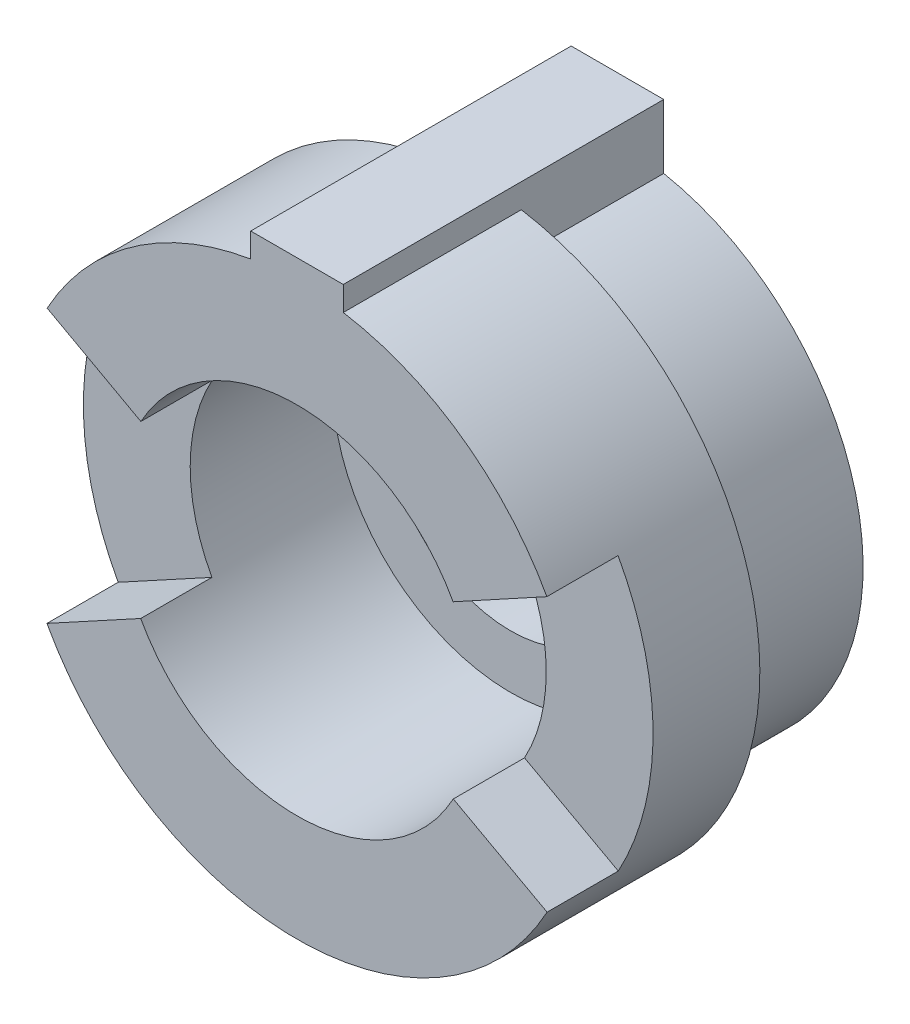
ISO-10303-21;
HEADER;
FILE_DESCRIPTION(('STEP AP214'),'2;1');
FILE_NAME('part.step','',(''),(''),'','','');
FILE_SCHEMA(('AUTOMOTIVE_DESIGN { 1 0 10303 214 1 1 1 1 }'));
ENDSEC;
DATA;
#1=APPLICATION_CONTEXT('core data for automotive mechanical design processes');
#2=APPLICATION_PROTOCOL_DEFINITION('international standard','automotive_design',2000,#1);
#3=PRODUCT_CONTEXT('',#1,'mechanical');
#4=PRODUCT('Part','Part','',(#3));
#5=PRODUCT_RELATED_PRODUCT_CATEGORY('part','',(#4));
#6=PRODUCT_DEFINITION_FORMATION('','',#4);
#7=PRODUCT_DEFINITION_CONTEXT('part definition',#1,'design');
#8=PRODUCT_DEFINITION('design','',#6,#7);
#9=PRODUCT_DEFINITION_SHAPE('','',#8);
#10=(LENGTH_UNIT() NAMED_UNIT(*) SI_UNIT(.MILLI.,.METRE.));
#11=(NAMED_UNIT(*) PLANE_ANGLE_UNIT() SI_UNIT($,.RADIAN.));
#12=(NAMED_UNIT(*) SI_UNIT($,.STERADIAN.) SOLID_ANGLE_UNIT());
#13=UNCERTAINTY_MEASURE_WITH_UNIT(LENGTH_MEASURE(1.E-05),#10,'distance_accuracy_value','');
#14=(GEOMETRIC_REPRESENTATION_CONTEXT(3) GLOBAL_UNCERTAINTY_ASSIGNED_CONTEXT((#13)) GLOBAL_UNIT_ASSIGNED_CONTEXT((#10,
#11,#12)) REPRESENTATION_CONTEXT('',''));
#15=CARTESIAN_POINT('',(0.,0.,0.));
#16=DIRECTION('',(0.,0.,1.));
#17=DIRECTION('',(1.,0.,0.));
#18=AXIS2_PLACEMENT_3D('',#15,#16,#17);
#19=CARTESIAN_POINT('',(0.,0.,9.));
#20=DIRECTION('',(0.,0.,1.));
#21=DIRECTION('',(1.,0.,0.));
#22=AXIS2_PLACEMENT_3D('',#19,#20,#21);
#23=PLANE('',#22);
#24=DIRECTION('',(0.,1.,0.));
#25=VECTOR('',#24,1.);
#26=CARTESIAN_POINT('',(-1.29999999999996,8.57642973843896,9.));
#27=LINE('',#26,#25);
#28=CARTESIAN_POINT('',(-1.29999999999996,7.89366834874636,9.));
#29=VERTEX_POINT('',#28);
#30=CARTESIAN_POINT('',(-1.29999999999996,8.57642973843896,9.));
#31=VERTEX_POINT('',#30);
#32=EDGE_CURVE('E181',#29,#31,#27,.T.);
#33=ORIENTED_EDGE('',*,*,#32,.F.);
#34=CARTESIAN_POINT('',(0.,0.,9.));
#35=DIRECTION('',(0.,0.,1.));
#36=DIRECTION('',(1.,0.,0.));
#37=AXIS2_PLACEMENT_3D('',#34,#35,#36);
#38=CIRCLE('',#37,8.);
#39=CARTESIAN_POINT('',(-7.01760403419745,3.84099383222828,9.));
#40=VERTEX_POINT('',#39);
#41=EDGE_CURVE('E84',#29,#40,#38,.T.);
#42=ORIENTED_EDGE('',*,*,#41,.T.);
#43=DIRECTION('',(-0.877200504274681,0.480124229028535,0.));
#44=VECTOR('',#43,1.);
#45=CARTESIAN_POINT('',(-7.01760403419745,3.84099383222828,9.));
#46=LINE('',#45,#44);
#47=CARTESIAN_POINT('',(-4.38600252137341,2.40062114514268,9.));
#48=VERTEX_POINT('',#47);
#49=EDGE_CURVE('E234',#48,#40,#46,.T.);
#50=ORIENTED_EDGE('',*,*,#49,.F.);
#51=CARTESIAN_POINT('',(0.,0.,9.));
#52=DIRECTION('',(0.,0.,1.));
#53=DIRECTION('',(1.,0.,0.));
#54=AXIS2_PLACEMENT_3D('',#51,#52,#53);
#55=CIRCLE('',#54,5.);
#56=CARTESIAN_POINT('',(4.38600252137341,2.40062114514267,9.));
#57=VERTEX_POINT('',#56);
#58=EDGE_CURVE('E259',#57,#48,#55,.T.);
#59=ORIENTED_EDGE('',*,*,#58,.F.);
#60=DIRECTION('',(0.877200504274682,0.480124229028534,0.));
#61=VECTOR('',#60,1.);
#62=CARTESIAN_POINT('',(7.01760403419745,3.84099383222827,9.));
#63=LINE('',#62,#61);
#64=CARTESIAN_POINT('',(7.01760403419745,3.84099383222827,9.));
#65=VERTEX_POINT('',#64);
#66=EDGE_CURVE('E255',#57,#65,#63,.T.);
#67=ORIENTED_EDGE('',*,*,#66,.T.);
#68=CARTESIAN_POINT('',(1.30000000000003,7.89366834874635,9.));
#69=VERTEX_POINT('',#68);
#70=EDGE_CURVE('E188',#65,#69,#38,.T.);
#71=ORIENTED_EDGE('',*,*,#70,.T.);
#72=DIRECTION('',(0.,-1.,0.));
#73=VECTOR('',#72,1.);
#74=CARTESIAN_POINT('',(1.30000000000003,7.79714939560114,9.));
#75=LINE('',#74,#73);
#76=CARTESIAN_POINT('',(1.30000000000003,8.57642973843896,9.));
#77=VERTEX_POINT('',#76);
#78=EDGE_CURVE('E173',#77,#69,#75,.T.);
#79=ORIENTED_EDGE('',*,*,#78,.F.);
#80=DIRECTION('',(1.,0.,0.));
#81=VECTOR('',#80,1.);
#82=CARTESIAN_POINT('',(1.30000000000003,8.57642973843896,9.));
#83=LINE('',#82,#81);
#84=EDGE_CURVE('E186',#31,#77,#83,.T.);
#85=ORIENTED_EDGE('',*,*,#84,.F.);
#86=EDGE_LOOP('',(#33,#42,#50,#59,#67,#71,#79,#85));
#87=FACE_BOUND('',#86,.T.);
#88=ADVANCED_FACE('F69',(#87),#23,.T.);
#89=CARTESIAN_POINT('',(0.,0.,3.));
#90=DIRECTION('',(0.,0.,1.));
#91=DIRECTION('',(1.,0.,0.));
#92=AXIS2_PLACEMENT_3D('',#89,#90,#91);
#93=PLANE('',#92);
#94=CARTESIAN_POINT('',(0.,0.,3.));
#95=DIRECTION('',(0.,0.,1.));
#96=DIRECTION('',(1.,0.,0.));
#97=AXIS2_PLACEMENT_3D('',#94,#95,#96);
#98=CIRCLE('',#97,5.);
#99=CARTESIAN_POINT('',(5.,0.,3.));
#100=VERTEX_POINT('',#99);
#101=EDGE_CURVE('E268',#100,#100,#98,.F.);
#102=ORIENTED_EDGE('',*,*,#101,.F.);
#103=EDGE_LOOP('',(#102));
#104=FACE_BOUND('',#103,.T.);
#105=CARTESIAN_POINT('',(0.,0.,3.));
#106=DIRECTION('',(0.,0.,1.));
#107=DIRECTION('',(1.,0.,0.));
#108=AXIS2_PLACEMENT_3D('',#105,#106,#107);
#109=CIRCLE('',#108,3.5);
#110=CARTESIAN_POINT('',(3.5,0.,3.));
#111=VERTEX_POINT('',#110);
#112=EDGE_CURVE('E265',#111,#111,#109,.T.);
#113=ORIENTED_EDGE('',*,*,#112,.F.);
#114=EDGE_LOOP('',(#113));
#115=FACE_BOUND('',#114,.T.);
#116=ADVANCED_FACE('F329',(#104,#115),#93,.T.);
#117=CARTESIAN_POINT('',(0.,0.,0.));
#118=DIRECTION('',(0.,0.,1.));
#119=DIRECTION('',(1.,0.,0.));
#120=AXIS2_PLACEMENT_3D('',#117,#118,#119);
#121=PLANE('',#120);
#122=CARTESIAN_POINT('',(0.,0.,0.));
#123=DIRECTION('',(0.,0.,1.));
#124=DIRECTION('',(-1.,0.,0.));
#125=AXIS2_PLACEMENT_3D('',#122,#123,#124);
#126=CIRCLE('',#125,6.9);
#127=CARTESIAN_POINT('',(-1.3,6.77642973843897,0.));
#128=VERTEX_POINT('',#127);
#129=CARTESIAN_POINT('',(1.30000000000003,6.77642973843896,0.));
#130=VERTEX_POINT('',#129);
#131=EDGE_CURVE('E215',#128,#130,#126,.T.);
#132=ORIENTED_EDGE('',*,*,#131,.F.);
#133=DIRECTION('',(0.,-1.,0.));
#134=VECTOR('',#133,1.);
#135=CARTESIAN_POINT('',(-1.3,7.89366834874636,0.));
#136=LINE('',#135,#134);
#137=CARTESIAN_POINT('',(-1.29999999999996,8.57642973843896,0.));
#138=VERTEX_POINT('',#137);
#139=EDGE_CURVE('E202',#138,#128,#136,.T.);
#140=ORIENTED_EDGE('',*,*,#139,.F.);
#141=DIRECTION('',(1.,0.,0.));
#142=VECTOR('',#141,1.);
#143=CARTESIAN_POINT('',(1.30000000000003,8.57642973843896,0.));
#144=LINE('',#143,#142);
#145=CARTESIAN_POINT('',(1.30000000000003,8.57642973843896,0.));
#146=VERTEX_POINT('',#145);
#147=EDGE_CURVE('E193',#138,#146,#144,.T.);
#148=ORIENTED_EDGE('',*,*,#147,.T.);
#149=DIRECTION('',(0.,1.,0.));
#150=VECTOR('',#149,1.);
#151=CARTESIAN_POINT('',(1.30000000000003,6.77642973843896,0.));
#152=LINE('',#151,#150);
#153=EDGE_CURVE('E175',#130,#146,#152,.T.);
#154=ORIENTED_EDGE('',*,*,#153,.F.);
#155=EDGE_LOOP('',(#132,#140,#148,#154));
#156=FACE_BOUND('',#155,.T.);
#157=CARTESIAN_POINT('',(0.,0.,0.));
#158=DIRECTION('',(0.,0.,1.));
#159=DIRECTION('',(1.,0.,0.));
#160=AXIS2_PLACEMENT_3D('',#157,#158,#159);
#161=CIRCLE('',#160,3.5);
#162=CARTESIAN_POINT('',(3.5,0.,0.));
#163=VERTEX_POINT('',#162);
#164=EDGE_CURVE('E264',#163,#163,#161,.T.);
#165=ORIENTED_EDGE('',*,*,#164,.T.);
#166=EDGE_LOOP('',(#165));
#167=FACE_BOUND('',#166,.T.);
#168=ADVANCED_FACE('F336',(#156,#167),#121,.F.);
#169=CARTESIAN_POINT('',(0.,0.,3.));
#170=DIRECTION('',(0.,0.,-1.));
#171=DIRECTION('',(-1.,0.,0.));
#172=AXIS2_PLACEMENT_3D('',#169,#170,#171);
#173=CYLINDRICAL_SURFACE('',#172,8.);
#174=ORIENTED_EDGE('',*,*,#41,.F.);
#175=DIRECTION('',(0.,0.,-1.));
#176=VECTOR('',#175,1.);
#177=CARTESIAN_POINT('',(-1.29999999999996,7.89366834874636,3.));
#178=LINE('',#177,#176);
#179=CARTESIAN_POINT('',(-1.3,7.89366834874636,4.));
#180=VERTEX_POINT('',#179);
#181=EDGE_CURVE('E200',#29,#180,#178,.T.);
#182=ORIENTED_EDGE('',*,*,#181,.T.);
#183=CARTESIAN_POINT('',(0.,0.,4.));
#184=DIRECTION('',(0.,0.,-1.));
#185=DIRECTION('',(-1.,0.,0.));
#186=AXIS2_PLACEMENT_3D('',#183,#184,#185);
#187=CIRCLE('',#186,8.);
#188=CARTESIAN_POINT('',(1.30000000000003,7.89366834874635,4.));
#189=VERTEX_POINT('',#188);
#190=EDGE_CURVE('E203',#189,#180,#187,.T.);
#191=ORIENTED_EDGE('',*,*,#190,.F.);
#192=DIRECTION('',(0.,0.,-1.));
#193=VECTOR('',#192,1.);
#194=CARTESIAN_POINT('',(1.30000000000003,7.89366834874635,3.));
#195=LINE('',#194,#193);
#196=EDGE_CURVE('E91',#189,#69,#195,.F.);
#197=ORIENTED_EDGE('',*,*,#196,.T.);
#198=ORIENTED_EDGE('',*,*,#70,.F.);
#199=DIRECTION('',(0.,0.,1.));
#200=VECTOR('',#199,1.);
#201=CARTESIAN_POINT('',(7.01760403419745,3.84099383222827,7.));
#202=LINE('',#201,#200);
#203=CARTESIAN_POINT('',(7.01760403419745,3.84099383222827,7.));
#204=VERTEX_POINT('',#203);
#205=EDGE_CURVE('E244',#204,#65,#202,.T.);
#206=ORIENTED_EDGE('',*,*,#205,.F.);
#207=CARTESIAN_POINT('',(0.,0.,7.));
#208=DIRECTION('',(0.,0.,-1.));
#209=DIRECTION('',(0.877964062999077,-0.478726544158722,0.));
#210=AXIS2_PLACEMENT_3D('',#207,#208,#209);
#211=CIRCLE('',#210,8.);
#212=CARTESIAN_POINT('',(7.02371250399262,-3.82981235326977,7.));
#213=VERTEX_POINT('',#212);
#214=EDGE_CURVE('E240',#204,#213,#211,.T.);
#215=ORIENTED_EDGE('',*,*,#214,.T.);
#216=DIRECTION('',(0.,0.,-1.));
#217=VECTOR('',#216,1.);
#218=CARTESIAN_POINT('',(7.02371250399262,-3.82981235326977,9.));
#219=LINE('',#218,#217);
#220=CARTESIAN_POINT('',(7.02371250399262,-3.82981235326977,9.));
#221=VERTEX_POINT('',#220);
#222=EDGE_CURVE('E246',#221,#213,#219,.T.);
#223=ORIENTED_EDGE('',*,*,#222,.F.);
#224=CARTESIAN_POINT('',(-7.02371250399263,-3.82981235326976,9.));
#225=VERTEX_POINT('',#224);
#226=EDGE_CURVE('E262',#225,#221,#38,.T.);
#227=ORIENTED_EDGE('',*,*,#226,.F.);
#228=DIRECTION('',(0.,0.,1.));
#229=VECTOR('',#228,1.);
#230=CARTESIAN_POINT('',(-7.02371250399263,-3.82981235326976,7.));
#231=LINE('',#230,#229);
#232=CARTESIAN_POINT('',(-7.02371250399263,-3.82981235326976,7.));
#233=VERTEX_POINT('',#232);
#234=EDGE_CURVE('E226',#233,#225,#231,.T.);
#235=ORIENTED_EDGE('',*,*,#234,.F.);
#236=CARTESIAN_POINT('',(0.,0.,7.));
#237=DIRECTION('',(0.,0.,-1.));
#238=DIRECTION('',(-0.877200504274681,0.480124229028534,0.));
#239=AXIS2_PLACEMENT_3D('',#236,#237,#238);
#240=CIRCLE('',#239,8.);
#241=CARTESIAN_POINT('',(-7.01760403419745,3.84099383222828,7.));
#242=VERTEX_POINT('',#241);
#243=EDGE_CURVE('E221',#233,#242,#240,.T.);
#244=ORIENTED_EDGE('',*,*,#243,.T.);
#245=DIRECTION('',(0.,0.,-1.));
#246=VECTOR('',#245,1.);
#247=CARTESIAN_POINT('',(-7.01760403419745,3.84099383222828,9.));
#248=LINE('',#247,#246);
#249=EDGE_CURVE('E228',#40,#242,#248,.T.);
#250=ORIENTED_EDGE('',*,*,#249,.F.);
#251=EDGE_LOOP('',(#174,#182,#191,#197,#198,#206,#215,#223,#227,#235,#244,#250));
#252=FACE_BOUND('',#251,.T.);
#253=ADVANCED_FACE('F71',(#252),#173,.T.);
#254=CARTESIAN_POINT('',(0.,0.,3.));
#255=DIRECTION('',(0.,0.,-1.));
#256=DIRECTION('',(-1.,0.,0.));
#257=AXIS2_PLACEMENT_3D('',#254,#255,#256);
#258=CYLINDRICAL_SURFACE('',#257,3.5);
#259=ORIENTED_EDGE('',*,*,#112,.T.);
#260=EDGE_LOOP('',(#259));
#261=FACE_BOUND('',#260,.T.);
#262=ORIENTED_EDGE('',*,*,#164,.F.);
#263=EDGE_LOOP('',(#262));
#264=FACE_BOUND('',#263,.T.);
#265=ADVANCED_FACE('F341',(#261,#264),#258,.F.);
#266=DIRECTION('',(-0.877964062999078,-0.47872654415872,0.));
#267=VECTOR('',#266,1.);
#268=CARTESIAN_POINT('',(-7.02371250399263,-3.82981235326976,9.));
#269=LINE('',#268,#267);
#270=CARTESIAN_POINT('',(-4.38982031499539,-2.3936327207936,9.));
#271=VERTEX_POINT('',#270);
#272=EDGE_CURVE('E237',#271,#225,#269,.T.);
#273=ORIENTED_EDGE('',*,*,#272,.T.);
#274=ORIENTED_EDGE('',*,*,#226,.T.);
#275=DIRECTION('',(0.877964062999077,-0.478726544158722,0.));
#276=VECTOR('',#275,1.);
#277=CARTESIAN_POINT('',(7.02371250399262,-3.82981235326977,9.));
#278=LINE('',#277,#276);
#279=CARTESIAN_POINT('',(4.38982031499539,-2.39363272079361,9.));
#280=VERTEX_POINT('',#279);
#281=EDGE_CURVE('E252',#280,#221,#278,.T.);
#282=ORIENTED_EDGE('',*,*,#281,.F.);
#283=EDGE_CURVE('E257',#271,#280,#55,.T.);
#284=ORIENTED_EDGE('',*,*,#283,.F.);
#285=EDGE_LOOP('',(#273,#274,#282,#284));
#286=FACE_BOUND('',#285,.T.);
#287=ADVANCED_FACE('F305',(#286),#23,.T.);
#288=CARTESIAN_POINT('',(0.,0.,9.));
#289=DIRECTION('',(0.,0.,-1.));
#290=DIRECTION('',(-1.,0.,0.));
#291=AXIS2_PLACEMENT_3D('',#288,#289,#290);
#292=CYLINDRICAL_SURFACE('',#291,5.);
#293=DIRECTION('',(0.,0.,-1.));
#294=VECTOR('',#293,1.);
#295=CARTESIAN_POINT('',(-4.38600252137341,2.40062114514268,9.));
#296=LINE('',#295,#294);
#297=CARTESIAN_POINT('',(-4.38600252137341,2.40062114514268,7.));
#298=VERTEX_POINT('',#297);
#299=EDGE_CURVE('E13',#298,#48,#296,.F.);
#300=ORIENTED_EDGE('',*,*,#299,.F.);
#301=CARTESIAN_POINT('',(0.,0.,7.));
#302=DIRECTION('',(0.,0.,1.));
#303=DIRECTION('',(1.,0.,0.));
#304=AXIS2_PLACEMENT_3D('',#301,#302,#303);
#305=CIRCLE('',#304,5.);
#306=CARTESIAN_POINT('',(-4.38982031499539,-2.3936327207936,7.));
#307=VERTEX_POINT('',#306);
#308=EDGE_CURVE('E77',#307,#298,#305,.F.);
#309=ORIENTED_EDGE('',*,*,#308,.F.);
#310=DIRECTION('',(0.,0.,-1.));
#311=VECTOR('',#310,1.);
#312=CARTESIAN_POINT('',(-4.38982031499539,-2.3936327207936,9.));
#313=LINE('',#312,#311);
#314=EDGE_CURVE('E280',#271,#307,#313,.T.);
#315=ORIENTED_EDGE('',*,*,#314,.F.);
#316=ORIENTED_EDGE('',*,*,#283,.T.);
#317=DIRECTION('',(0.,0.,-1.));
#318=VECTOR('',#317,1.);
#319=CARTESIAN_POINT('',(4.38982031499539,-2.39363272079361,9.));
#320=LINE('',#319,#318);
#321=CARTESIAN_POINT('',(4.38982031499539,-2.39363272079361,7.));
#322=VERTEX_POINT('',#321);
#323=EDGE_CURVE('E277',#322,#280,#320,.F.);
#324=ORIENTED_EDGE('',*,*,#323,.F.);
#325=CARTESIAN_POINT('',(0.,0.,7.));
#326=DIRECTION('',(0.,0.,1.));
#327=DIRECTION('',(1.,0.,0.));
#328=AXIS2_PLACEMENT_3D('',#325,#326,#327);
#329=CIRCLE('',#328,5.);
#330=CARTESIAN_POINT('',(4.38600252137341,2.40062114514267,7.));
#331=VERTEX_POINT('',#330);
#332=EDGE_CURVE('E275',#331,#322,#329,.F.);
#333=ORIENTED_EDGE('',*,*,#332,.F.);
#334=DIRECTION('',(0.,0.,-1.));
#335=VECTOR('',#334,1.);
#336=CARTESIAN_POINT('',(4.38600252137341,2.40062114514267,9.));
#337=LINE('',#336,#335);
#338=EDGE_CURVE('E273',#57,#331,#337,.T.);
#339=ORIENTED_EDGE('',*,*,#338,.F.);
#340=ORIENTED_EDGE('',*,*,#58,.T.);
#341=EDGE_LOOP('',(#300,#309,#315,#316,#324,#333,#339,#340));
#342=FACE_BOUND('',#341,.T.);
#343=ORIENTED_EDGE('',*,*,#101,.T.);
#344=EDGE_LOOP('',(#343));
#345=FACE_BOUND('',#344,.T.);
#346=ADVANCED_FACE('F293',(#342,#345),#292,.F.);
#347=CARTESIAN_POINT('',(7.02371250399262,-3.82981235326977,8.));
#348=DIRECTION('',(-0.478726544158722,-0.877964062999077,0.));
#349=DIRECTION('',(0.,0.,-1.));
#350=AXIS2_PLACEMENT_3D('',#347,#348,#349);
#351=PLANE('',#350);
#352=ORIENTED_EDGE('',*,*,#323,.T.);
#353=ORIENTED_EDGE('',*,*,#281,.T.);
#354=ORIENTED_EDGE('',*,*,#222,.T.);
#355=DIRECTION('',(0.877964062999077,-0.478726544158722,0.));
#356=VECTOR('',#355,1.);
#357=CARTESIAN_POINT('',(7.02371250399262,-3.82981235326977,7.));
#358=LINE('',#357,#356);
#359=EDGE_CURVE('E250',#322,#213,#358,.T.);
#360=ORIENTED_EDGE('',*,*,#359,.F.);
#361=EDGE_LOOP('',(#352,#353,#354,#360));
#362=FACE_BOUND('',#361,.T.);
#363=ADVANCED_FACE('F310',(#362),#351,.F.);
#364=CARTESIAN_POINT('',(0.,0.,7.));
#365=DIRECTION('',(0.,0.,1.));
#366=DIRECTION('',(1.,0.,0.));
#367=AXIS2_PLACEMENT_3D('',#364,#365,#366);
#368=PLANE('',#367);
#369=ORIENTED_EDGE('',*,*,#332,.T.);
#370=ORIENTED_EDGE('',*,*,#359,.T.);
#371=ORIENTED_EDGE('',*,*,#214,.F.);
#372=DIRECTION('',(0.877200504274682,0.480124229028534,0.));
#373=VECTOR('',#372,1.);
#374=CARTESIAN_POINT('',(7.01760403419745,3.84099383222827,7.));
#375=LINE('',#374,#373);
#376=EDGE_CURVE('E249',#331,#204,#375,.T.);
#377=ORIENTED_EDGE('',*,*,#376,.F.);
#378=EDGE_LOOP('',(#369,#370,#371,#377));
#379=FACE_BOUND('',#378,.T.);
#380=ADVANCED_FACE('F313',(#379),#368,.T.);
#381=CARTESIAN_POINT('',(7.01760403419745,3.84099383222827,8.));
#382=DIRECTION('',(-0.480124229028534,0.877200504274682,0.));
#383=DIRECTION('',(0.,0.,1.));
#384=AXIS2_PLACEMENT_3D('',#381,#382,#383);
#385=PLANE('',#384);
#386=ORIENTED_EDGE('',*,*,#338,.T.);
#387=ORIENTED_EDGE('',*,*,#376,.T.);
#388=ORIENTED_EDGE('',*,*,#205,.T.);
#389=ORIENTED_EDGE('',*,*,#66,.F.);
#390=EDGE_LOOP('',(#386,#387,#388,#389));
#391=FACE_BOUND('',#390,.T.);
#392=ADVANCED_FACE('F317',(#391),#385,.F.);
#393=CARTESIAN_POINT('',(-7.01760403419745,3.84099383222828,8.));
#394=DIRECTION('',(0.480124229028535,0.877200504274681,0.));
#395=DIRECTION('',(0.,0.,-1.));
#396=AXIS2_PLACEMENT_3D('',#393,#394,#395);
#397=PLANE('',#396);
#398=ORIENTED_EDGE('',*,*,#299,.T.);
#399=ORIENTED_EDGE('',*,*,#49,.T.);
#400=ORIENTED_EDGE('',*,*,#249,.T.);
#401=DIRECTION('',(-0.877200504274681,0.480124229028535,0.));
#402=VECTOR('',#401,1.);
#403=CARTESIAN_POINT('',(-7.01760403419745,3.84099383222828,7.));
#404=LINE('',#403,#402);
#405=EDGE_CURVE('E232',#298,#242,#404,.T.);
#406=ORIENTED_EDGE('',*,*,#405,.F.);
#407=EDGE_LOOP('',(#398,#399,#400,#406));
#408=FACE_BOUND('',#407,.T.);
#409=ADVANCED_FACE('F291',(#408),#397,.F.);
#410=CARTESIAN_POINT('',(0.,0.,7.));
#411=DIRECTION('',(0.,0.,1.));
#412=DIRECTION('',(1.,0.,0.));
#413=AXIS2_PLACEMENT_3D('',#410,#411,#412);
#414=PLANE('',#413);
#415=ORIENTED_EDGE('',*,*,#308,.T.);
#416=ORIENTED_EDGE('',*,*,#405,.T.);
#417=ORIENTED_EDGE('',*,*,#243,.F.);
#418=DIRECTION('',(-0.877964062999078,-0.47872654415872,0.));
#419=VECTOR('',#418,1.);
#420=CARTESIAN_POINT('',(-7.02371250399263,-3.82981235326976,7.));
#421=LINE('',#420,#419);
#422=EDGE_CURVE('E231',#307,#233,#421,.T.);
#423=ORIENTED_EDGE('',*,*,#422,.F.);
#424=EDGE_LOOP('',(#415,#416,#417,#423));
#425=FACE_BOUND('',#424,.T.);
#426=ADVANCED_FACE('F285',(#425),#414,.T.);
#427=CARTESIAN_POINT('',(-7.02371250399263,-3.82981235326976,8.));
#428=DIRECTION('',(0.47872654415872,-0.877964062999078,0.));
#429=DIRECTION('',(0.,0.,1.));
#430=AXIS2_PLACEMENT_3D('',#427,#428,#429);
#431=PLANE('',#430);
#432=ORIENTED_EDGE('',*,*,#314,.T.);
#433=ORIENTED_EDGE('',*,*,#422,.T.);
#434=ORIENTED_EDGE('',*,*,#234,.T.);
#435=ORIENTED_EDGE('',*,*,#272,.F.);
#436=EDGE_LOOP('',(#432,#433,#434,#435));
#437=FACE_BOUND('',#436,.T.);
#438=ADVANCED_FACE('F302',(#437),#431,.F.);
#439=CARTESIAN_POINT('',(1.30000000000003,6.77642973843896,4.));
#440=DIRECTION('',(-1.,0.,0.));
#441=DIRECTION('',(0.,-1.,0.));
#442=AXIS2_PLACEMENT_3D('',#439,#440,#441);
#443=PLANE('',#442);
#444=ORIENTED_EDGE('',*,*,#153,.T.);
#445=DIRECTION('',(0.,0.,-1.));
#446=VECTOR('',#445,1.);
#447=CARTESIAN_POINT('',(1.30000000000003,8.57642973843896,9.));
#448=LINE('',#447,#446);
#449=EDGE_CURVE('E170',#77,#146,#448,.T.);
#450=ORIENTED_EDGE('',*,*,#449,.F.);
#451=ORIENTED_EDGE('',*,*,#78,.T.);
#452=ORIENTED_EDGE('',*,*,#196,.F.);
#453=DIRECTION('',(0.,1.,0.));
#454=VECTOR('',#453,1.);
#455=CARTESIAN_POINT('',(1.30000000000003,6.77642973843896,4.));
#456=LINE('',#455,#454);
#457=CARTESIAN_POINT('',(1.30000000000003,6.77642973843896,4.));
#458=VERTEX_POINT('',#457);
#459=EDGE_CURVE('E211',#458,#189,#456,.T.);
#460=ORIENTED_EDGE('',*,*,#459,.F.);
#461=DIRECTION('',(0.,0.,-1.));
#462=VECTOR('',#461,1.);
#463=CARTESIAN_POINT('',(1.30000000000003,6.77642973843896,4.));
#464=LINE('',#463,#462);
#465=EDGE_CURVE('E219',#458,#130,#464,.T.);
#466=ORIENTED_EDGE('',*,*,#465,.T.);
#467=EDGE_LOOP('',(#444,#450,#451,#452,#460,#466));
#468=FACE_BOUND('',#467,.T.);
#469=ADVANCED_FACE('F172',(#468),#443,.F.);
#470=CARTESIAN_POINT('',(0.,0.,4.));
#471=DIRECTION('',(0.,0.,-1.));
#472=DIRECTION('',(-1.,0.,0.));
#473=AXIS2_PLACEMENT_3D('',#470,#471,#472);
#474=CYLINDRICAL_SURFACE('',#473,6.9);
#475=ORIENTED_EDGE('',*,*,#131,.T.);
#476=ORIENTED_EDGE('',*,*,#465,.F.);
#477=CARTESIAN_POINT('',(0.,0.,4.));
#478=DIRECTION('',(0.,0.,1.));
#479=DIRECTION('',(-1.,0.,0.));
#480=AXIS2_PLACEMENT_3D('',#477,#478,#479);
#481=CIRCLE('',#480,6.9);
#482=CARTESIAN_POINT('',(-1.3,6.77642973843897,4.));
#483=VERTEX_POINT('',#482);
#484=EDGE_CURVE('E208',#483,#458,#481,.T.);
#485=ORIENTED_EDGE('',*,*,#484,.F.);
#486=DIRECTION('',(0.,0.,-1.));
#487=VECTOR('',#486,1.);
#488=CARTESIAN_POINT('',(-1.3,6.77642973843897,4.));
#489=LINE('',#488,#487);
#490=EDGE_CURVE('E213',#483,#128,#489,.T.);
#491=ORIENTED_EDGE('',*,*,#490,.T.);
#492=EDGE_LOOP('',(#475,#476,#485,#491));
#493=FACE_BOUND('',#492,.T.);
#494=ADVANCED_FACE('F360',(#493),#474,.T.);
#495=CARTESIAN_POINT('',(-1.3,7.89366834874636,4.));
#496=DIRECTION('',(1.,0.,0.));
#497=DIRECTION('',(0.,1.,0.));
#498=AXIS2_PLACEMENT_3D('',#495,#496,#497);
#499=PLANE('',#498);
#500=ORIENTED_EDGE('',*,*,#490,.F.);
#501=DIRECTION('',(0.,-1.,0.));
#502=VECTOR('',#501,1.);
#503=CARTESIAN_POINT('',(-1.3,7.89366834874636,4.));
#504=LINE('',#503,#502);
#505=EDGE_CURVE('E206',#180,#483,#504,.T.);
#506=ORIENTED_EDGE('',*,*,#505,.F.);
#507=ORIENTED_EDGE('',*,*,#181,.F.);
#508=ORIENTED_EDGE('',*,*,#32,.T.);
#509=DIRECTION('',(0.,0.,-1.));
#510=VECTOR('',#509,1.);
#511=CARTESIAN_POINT('',(-1.29999999999996,8.57642973843896,9.));
#512=LINE('',#511,#510);
#513=EDGE_CURVE('E180',#31,#138,#512,.T.);
#514=ORIENTED_EDGE('',*,*,#513,.T.);
#515=ORIENTED_EDGE('',*,*,#139,.T.);
#516=EDGE_LOOP('',(#500,#506,#507,#508,#514,#515));
#517=FACE_BOUND('',#516,.T.);
#518=ADVANCED_FACE('F365',(#517),#499,.F.);
#519=CARTESIAN_POINT('',(0.,0.,4.));
#520=DIRECTION('',(0.,0.,-1.));
#521=DIRECTION('',(-1.,0.,0.));
#522=AXIS2_PLACEMENT_3D('',#519,#520,#521);
#523=PLANE('',#522);
#524=ORIENTED_EDGE('',*,*,#190,.T.);
#525=ORIENTED_EDGE('',*,*,#505,.T.);
#526=ORIENTED_EDGE('',*,*,#484,.T.);
#527=ORIENTED_EDGE('',*,*,#459,.T.);
#528=EDGE_LOOP('',(#524,#525,#526,#527));
#529=FACE_BOUND('',#528,.T.);
#530=ADVANCED_FACE('F368',(#529),#523,.T.);
#531=CARTESIAN_POINT('',(1.30000000000003,8.57642973843896,9.));
#532=DIRECTION('',(0.,1.,0.));
#533=DIRECTION('',(-1.,0.,0.));
#534=AXIS2_PLACEMENT_3D('',#531,#532,#533);
#535=PLANE('',#534);
#536=ORIENTED_EDGE('',*,*,#147,.F.);
#537=ORIENTED_EDGE('',*,*,#513,.F.);
#538=ORIENTED_EDGE('',*,*,#84,.T.);
#539=ORIENTED_EDGE('',*,*,#449,.T.);
#540=EDGE_LOOP('',(#536,#537,#538,#539));
#541=FACE_BOUND('',#540,.T.);
#542=ADVANCED_FACE('F191',(#541),#535,.T.);
#543=CLOSED_SHELL('',(#88,#116,#168,#253,#265,#287,#346,#363,#380,#392,#409,#426,#438,#469,#494,
#518,#530,#542));
#544=MANIFOLD_SOLID_BREP('B2',#543);
#545=ADVANCED_BREP_SHAPE_REPRESENTATION('',(#18,#544),#14);
#546=SHAPE_DEFINITION_REPRESENTATION(#9,#545);
ENDSEC;
END-ISO-10303-21;
